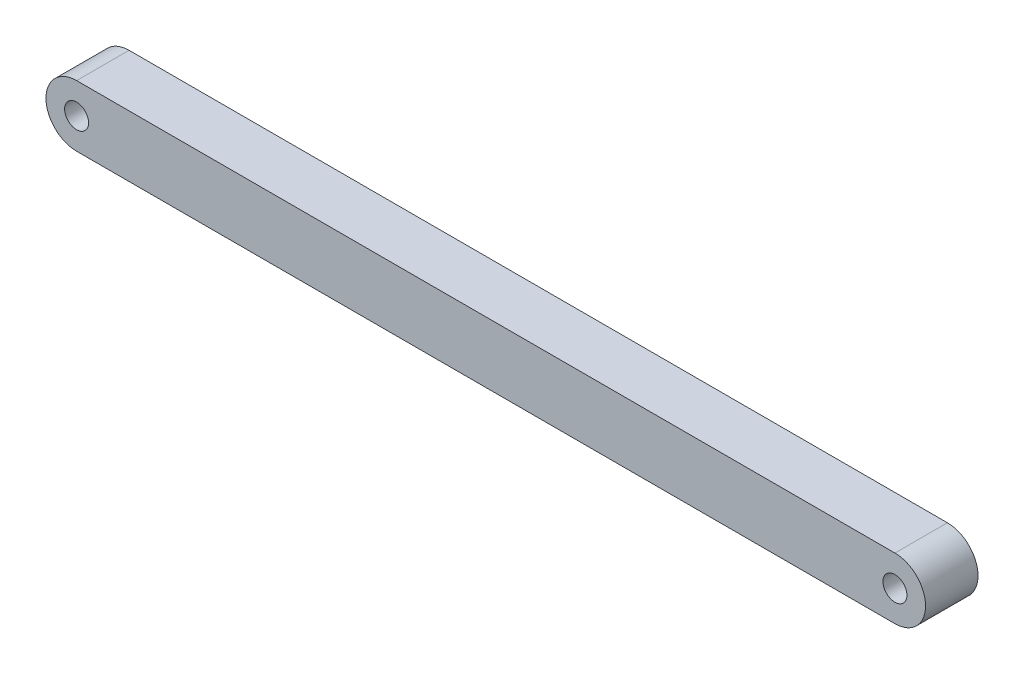
ISO-10303-21;
HEADER;
FILE_DESCRIPTION(('STEP AP214'),'2;1');
FILE_NAME('part.step','',(''),(''),'','','');
FILE_SCHEMA(('AUTOMOTIVE_DESIGN { 1 0 10303 214 1 1 1 1 }'));
ENDSEC;
DATA;
#1=APPLICATION_CONTEXT('core data for automotive mechanical design processes');
#2=APPLICATION_PROTOCOL_DEFINITION('international standard','automotive_design',2000,#1);
#3=PRODUCT_CONTEXT('',#1,'mechanical');
#4=PRODUCT('Part','Part','',(#3));
#5=PRODUCT_RELATED_PRODUCT_CATEGORY('part','',(#4));
#6=PRODUCT_DEFINITION_FORMATION('','',#4);
#7=PRODUCT_DEFINITION_CONTEXT('part definition',#1,'design');
#8=PRODUCT_DEFINITION('design','',#6,#7);
#9=PRODUCT_DEFINITION_SHAPE('','',#8);
#10=(LENGTH_UNIT() NAMED_UNIT(*) SI_UNIT(.MILLI.,.METRE.));
#11=(NAMED_UNIT(*) PLANE_ANGLE_UNIT() SI_UNIT($,.RADIAN.));
#12=(NAMED_UNIT(*) SI_UNIT($,.STERADIAN.) SOLID_ANGLE_UNIT());
#13=UNCERTAINTY_MEASURE_WITH_UNIT(LENGTH_MEASURE(1.E-05),#10,'distance_accuracy_value','');
#14=(GEOMETRIC_REPRESENTATION_CONTEXT(3) GLOBAL_UNCERTAINTY_ASSIGNED_CONTEXT((#13)) GLOBAL_UNIT_ASSIGNED_CONTEXT((#10,
#11,#12)) REPRESENTATION_CONTEXT('',''));
#15=CARTESIAN_POINT('',(0.,0.,0.));
#16=DIRECTION('',(0.,0.,1.));
#17=DIRECTION('',(1.,0.,0.));
#18=AXIS2_PLACEMENT_3D('',#15,#16,#17);
#19=CARTESIAN_POINT('',(0.,0.,7.62));
#20=DIRECTION('',(0.,0.,-1.));
#21=DIRECTION('',(-1.,0.,0.));
#22=AXIS2_PLACEMENT_3D('',#19,#20,#21);
#23=CYLINDRICAL_SURFACE('',#22,4.445);
#24=CARTESIAN_POINT('',(0.,0.,0.));
#25=DIRECTION('',(0.,0.,1.));
#26=DIRECTION('',(1.,0.,0.));
#27=AXIS2_PLACEMENT_3D('',#24,#25,#26);
#28=CIRCLE('',#27,4.445);
#29=CARTESIAN_POINT('',(0.,4.445,0.));
#30=VERTEX_POINT('',#29);
#31=CARTESIAN_POINT('',(0.,-4.445,0.));
#32=VERTEX_POINT('',#31);
#33=EDGE_CURVE('E95',#30,#32,#28,.T.);
#34=ORIENTED_EDGE('',*,*,#33,.T.);
#35=DIRECTION('',(0.,0.,-1.));
#36=VECTOR('',#35,1.);
#37=CARTESIAN_POINT('',(0.,-4.445,7.62));
#38=LINE('',#37,#36);
#39=CARTESIAN_POINT('',(0.,-4.445,7.62));
#40=VERTEX_POINT('',#39);
#41=EDGE_CURVE('E11',#40,#32,#38,.T.);
#42=ORIENTED_EDGE('',*,*,#41,.F.);
#43=CARTESIAN_POINT('',(0.,0.,7.62));
#44=DIRECTION('',(0.,0.,1.));
#45=DIRECTION('',(1.,0.,0.));
#46=AXIS2_PLACEMENT_3D('',#43,#44,#45);
#47=CIRCLE('',#46,4.445);
#48=CARTESIAN_POINT('',(0.,4.445,7.62));
#49=VERTEX_POINT('',#48);
#50=EDGE_CURVE('E83',#49,#40,#47,.T.);
#51=ORIENTED_EDGE('',*,*,#50,.F.);
#52=DIRECTION('',(0.,0.,-1.));
#53=VECTOR('',#52,1.);
#54=CARTESIAN_POINT('',(0.,4.445,7.62));
#55=LINE('',#54,#53);
#56=EDGE_CURVE('E91',#49,#30,#55,.T.);
#57=ORIENTED_EDGE('',*,*,#56,.T.);
#58=EDGE_LOOP('',(#34,#42,#51,#57));
#59=FACE_BOUND('',#58,.T.);
#60=ADVANCED_FACE('F32',(#59),#23,.T.);
#61=CARTESIAN_POINT('',(0.,-4.445,7.62));
#62=DIRECTION('',(0.,1.,0.));
#63=DIRECTION('',(0.,0.,1.));
#64=AXIS2_PLACEMENT_3D('',#61,#62,#63);
#65=PLANE('',#64);
#66=DIRECTION('',(1.,0.,0.));
#67=VECTOR('',#66,1.);
#68=CARTESIAN_POINT('',(0.,-4.445,0.));
#69=LINE('',#68,#67);
#70=CARTESIAN_POINT('',(118.872,-4.445,0.));
#71=VERTEX_POINT('',#70);
#72=EDGE_CURVE('E87',#32,#71,#69,.T.);
#73=ORIENTED_EDGE('',*,*,#72,.T.);
#74=DIRECTION('',(0.,0.,-1.));
#75=VECTOR('',#74,1.);
#76=CARTESIAN_POINT('',(118.872,-4.445,7.62));
#77=LINE('',#76,#75);
#78=CARTESIAN_POINT('',(118.872,-4.445,7.62));
#79=VERTEX_POINT('',#78);
#80=EDGE_CURVE('E40',#79,#71,#77,.T.);
#81=ORIENTED_EDGE('',*,*,#80,.F.);
#82=DIRECTION('',(1.,0.,0.));
#83=VECTOR('',#82,1.);
#84=CARTESIAN_POINT('',(0.,-4.445,7.62));
#85=LINE('',#84,#83);
#86=EDGE_CURVE('E78',#40,#79,#85,.T.);
#87=ORIENTED_EDGE('',*,*,#86,.F.);
#88=ORIENTED_EDGE('',*,*,#41,.T.);
#89=EDGE_LOOP('',(#73,#81,#87,#88));
#90=FACE_BOUND('',#89,.T.);
#91=ADVANCED_FACE('F86',(#90),#65,.F.);
#92=CARTESIAN_POINT('',(118.872,0.,7.62));
#93=DIRECTION('',(0.,0.,-1.));
#94=DIRECTION('',(-1.,0.,0.));
#95=AXIS2_PLACEMENT_3D('',#92,#93,#94);
#96=CYLINDRICAL_SURFACE('',#95,4.445);
#97=CARTESIAN_POINT('',(118.872,0.,0.));
#98=DIRECTION('',(0.,0.,1.));
#99=DIRECTION('',(1.,0.,0.));
#100=AXIS2_PLACEMENT_3D('',#97,#98,#99);
#101=CIRCLE('',#100,4.445);
#102=CARTESIAN_POINT('',(118.872,4.445,0.));
#103=VERTEX_POINT('',#102);
#104=EDGE_CURVE('E65',#71,#103,#101,.T.);
#105=ORIENTED_EDGE('',*,*,#104,.T.);
#106=DIRECTION('',(0.,0.,-1.));
#107=VECTOR('',#106,1.);
#108=CARTESIAN_POINT('',(118.872,4.445,7.62));
#109=LINE('',#108,#107);
#110=CARTESIAN_POINT('',(118.872,4.445,7.62));
#111=VERTEX_POINT('',#110);
#112=EDGE_CURVE('E88',#111,#103,#109,.T.);
#113=ORIENTED_EDGE('',*,*,#112,.F.);
#114=CARTESIAN_POINT('',(118.872,0.,7.62));
#115=DIRECTION('',(0.,0.,1.));
#116=DIRECTION('',(1.,0.,0.));
#117=AXIS2_PLACEMENT_3D('',#114,#115,#116);
#118=CIRCLE('',#117,4.445);
#119=EDGE_CURVE('E81',#79,#111,#118,.T.);
#120=ORIENTED_EDGE('',*,*,#119,.F.);
#121=ORIENTED_EDGE('',*,*,#80,.T.);
#122=EDGE_LOOP('',(#105,#113,#120,#121));
#123=FACE_BOUND('',#122,.T.);
#124=ADVANCED_FACE('F89',(#123),#96,.T.);
#125=CARTESIAN_POINT('',(0.,4.445,7.62));
#126=DIRECTION('',(0.,-1.,0.));
#127=DIRECTION('',(0.,0.,-1.));
#128=AXIS2_PLACEMENT_3D('',#125,#126,#127);
#129=PLANE('',#128);
#130=DIRECTION('',(-1.,0.,0.));
#131=VECTOR('',#130,1.);
#132=CARTESIAN_POINT('',(0.,4.445,0.));
#133=LINE('',#132,#131);
#134=EDGE_CURVE('E71',#103,#30,#133,.T.);
#135=ORIENTED_EDGE('',*,*,#134,.T.);
#136=ORIENTED_EDGE('',*,*,#56,.F.);
#137=DIRECTION('',(-1.,0.,0.));
#138=VECTOR('',#137,1.);
#139=CARTESIAN_POINT('',(0.,4.445,7.62));
#140=LINE('',#139,#138);
#141=EDGE_CURVE('E48',#111,#49,#140,.T.);
#142=ORIENTED_EDGE('',*,*,#141,.F.);
#143=ORIENTED_EDGE('',*,*,#112,.T.);
#144=EDGE_LOOP('',(#135,#136,#142,#143));
#145=FACE_BOUND('',#144,.T.);
#146=ADVANCED_FACE('F103',(#145),#129,.F.);
#147=CARTESIAN_POINT('',(0.,0.,7.62));
#148=DIRECTION('',(0.,0.,1.));
#149=DIRECTION('',(1.,0.,0.));
#150=AXIS2_PLACEMENT_3D('',#147,#148,#149);
#151=PLANE('',#150);
#152=CARTESIAN_POINT('',(118.872,0.,7.62));
#153=DIRECTION('',(0.,0.,1.));
#154=DIRECTION('',(1.,0.,0.));
#155=AXIS2_PLACEMENT_3D('',#152,#153,#154);
#156=CIRCLE('',#155,1.7399);
#157=CARTESIAN_POINT('',(120.6119,0.,7.62));
#158=VERTEX_POINT('',#157);
#159=EDGE_CURVE('E114',#158,#158,#156,.F.);
#160=ORIENTED_EDGE('',*,*,#159,.T.);
#161=EDGE_LOOP('',(#160));
#162=FACE_BOUND('',#161,.T.);
#163=CARTESIAN_POINT('',(0.,0.,7.62));
#164=DIRECTION('',(0.,0.,1.));
#165=DIRECTION('',(1.,0.,0.));
#166=AXIS2_PLACEMENT_3D('',#163,#164,#165);
#167=CIRCLE('',#166,1.7399);
#168=CARTESIAN_POINT('',(1.7399,0.,7.62));
#169=VERTEX_POINT('',#168);
#170=EDGE_CURVE('E98',#169,#169,#167,.T.);
#171=ORIENTED_EDGE('',*,*,#170,.F.);
#172=EDGE_LOOP('',(#171));
#173=FACE_BOUND('',#172,.T.);
#174=ORIENTED_EDGE('',*,*,#50,.T.);
#175=ORIENTED_EDGE('',*,*,#86,.T.);
#176=ORIENTED_EDGE('',*,*,#119,.T.);
#177=ORIENTED_EDGE('',*,*,#141,.T.);
#178=EDGE_LOOP('',(#174,#175,#176,#177));
#179=FACE_BOUND('',#178,.T.);
#180=ADVANCED_FACE('F79',(#162,#173,#179),#151,.T.);
#181=CARTESIAN_POINT('',(0.,0.,0.));
#182=DIRECTION('',(0.,0.,1.));
#183=DIRECTION('',(1.,0.,0.));
#184=AXIS2_PLACEMENT_3D('',#181,#182,#183);
#185=PLANE('',#184);
#186=CARTESIAN_POINT('',(118.872,0.,0.));
#187=DIRECTION('',(0.,0.,-1.));
#188=DIRECTION('',(-1.,0.,0.));
#189=AXIS2_PLACEMENT_3D('',#186,#187,#188);
#190=CIRCLE('',#189,1.7399);
#191=CARTESIAN_POINT('',(117.1321,0.,0.));
#192=VERTEX_POINT('',#191);
#193=EDGE_CURVE('E117',#192,#192,#190,.T.);
#194=ORIENTED_EDGE('',*,*,#193,.F.);
#195=EDGE_LOOP('',(#194));
#196=FACE_BOUND('',#195,.T.);
#197=CARTESIAN_POINT('',(0.,0.,0.));
#198=DIRECTION('',(0.,0.,1.));
#199=DIRECTION('',(1.,0.,0.));
#200=AXIS2_PLACEMENT_3D('',#197,#198,#199);
#201=CIRCLE('',#200,1.7399);
#202=CARTESIAN_POINT('',(1.7399,0.,0.));
#203=VERTEX_POINT('',#202);
#204=EDGE_CURVE('E111',#203,#203,#201,.T.);
#205=ORIENTED_EDGE('',*,*,#204,.T.);
#206=EDGE_LOOP('',(#205));
#207=FACE_BOUND('',#206,.T.);
#208=ORIENTED_EDGE('',*,*,#33,.F.);
#209=ORIENTED_EDGE('',*,*,#134,.F.);
#210=ORIENTED_EDGE('',*,*,#104,.F.);
#211=ORIENTED_EDGE('',*,*,#72,.F.);
#212=EDGE_LOOP('',(#208,#209,#210,#211));
#213=FACE_BOUND('',#212,.T.);
#214=ADVANCED_FACE('F106',(#196,#207,#213),#185,.F.);
#215=CARTESIAN_POINT('',(0.,0.,0.));
#216=DIRECTION('',(0.,0.,1.));
#217=DIRECTION('',(1.,0.,0.));
#218=AXIS2_PLACEMENT_3D('',#215,#216,#217);
#219=CYLINDRICAL_SURFACE('',#218,1.7399);
#220=ORIENTED_EDGE('',*,*,#170,.T.);
#221=EDGE_LOOP('',(#220));
#222=FACE_BOUND('',#221,.T.);
#223=ORIENTED_EDGE('',*,*,#204,.F.);
#224=EDGE_LOOP('',(#223));
#225=FACE_BOUND('',#224,.T.);
#226=ADVANCED_FACE('F125',(#222,#225),#219,.F.);
#227=CARTESIAN_POINT('',(118.872,0.,0.));
#228=DIRECTION('',(0.,0.,1.));
#229=DIRECTION('',(1.,0.,0.));
#230=AXIS2_PLACEMENT_3D('',#227,#228,#229);
#231=CYLINDRICAL_SURFACE('',#230,1.7399);
#232=ORIENTED_EDGE('',*,*,#159,.F.);
#233=EDGE_LOOP('',(#232));
#234=FACE_BOUND('',#233,.T.);
#235=ORIENTED_EDGE('',*,*,#193,.T.);
#236=EDGE_LOOP('',(#235));
#237=FACE_BOUND('',#236,.T.);
#238=ADVANCED_FACE('F121',(#234,#237),#231,.F.);
#239=CLOSED_SHELL('',(#60,#91,#124,#146,#180,#214,#226,#238));
#240=MANIFOLD_SOLID_BREP('B2',#239);
#241=ADVANCED_BREP_SHAPE_REPRESENTATION('',(#18,#240),#14);
#242=SHAPE_DEFINITION_REPRESENTATION(#9,#241);
ENDSEC;
END-ISO-10303-21;
